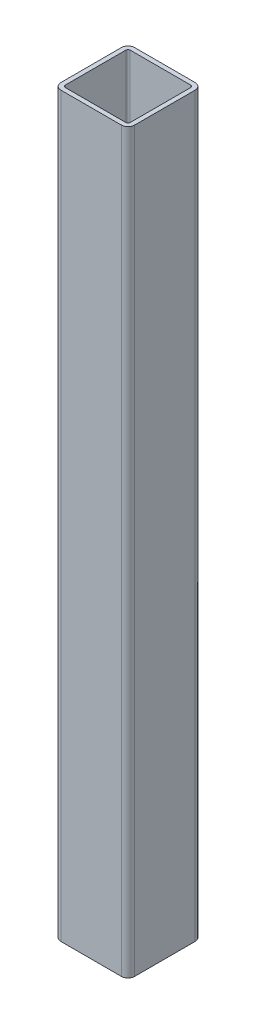
ISO-10303-21;
HEADER;
FILE_DESCRIPTION(('STEP AP214'),'2;1');
FILE_NAME('part.step','',(''),(''),'','','');
FILE_SCHEMA(('AUTOMOTIVE_DESIGN { 1 0 10303 214 1 1 1 1 }'));
ENDSEC;
DATA;
#1=APPLICATION_CONTEXT('core data for automotive mechanical design processes');
#2=APPLICATION_PROTOCOL_DEFINITION('international standard','automotive_design',2000,#1);
#3=PRODUCT_CONTEXT('',#1,'mechanical');
#4=PRODUCT('Part','Part','',(#3));
#5=PRODUCT_RELATED_PRODUCT_CATEGORY('part','',(#4));
#6=PRODUCT_DEFINITION_FORMATION('','',#4);
#7=PRODUCT_DEFINITION_CONTEXT('part definition',#1,'design');
#8=PRODUCT_DEFINITION('design','',#6,#7);
#9=PRODUCT_DEFINITION_SHAPE('','',#8);
#10=(LENGTH_UNIT() NAMED_UNIT(*) SI_UNIT(.MILLI.,.METRE.));
#11=(NAMED_UNIT(*) PLANE_ANGLE_UNIT() SI_UNIT($,.RADIAN.));
#12=(NAMED_UNIT(*) SI_UNIT($,.STERADIAN.) SOLID_ANGLE_UNIT());
#13=UNCERTAINTY_MEASURE_WITH_UNIT(LENGTH_MEASURE(1.E-05),#10,'distance_accuracy_value','');
#14=(GEOMETRIC_REPRESENTATION_CONTEXT(3) GLOBAL_UNCERTAINTY_ASSIGNED_CONTEXT((#13)) GLOBAL_UNIT_ASSIGNED_CONTEXT((#10,
#11,#12)) REPRESENTATION_CONTEXT('',''));
#15=CARTESIAN_POINT('',(0.,0.,0.));
#16=DIRECTION('',(0.,0.,1.));
#17=DIRECTION('',(1.,0.,0.));
#18=AXIS2_PLACEMENT_3D('',#15,#16,#17);
#19=CARTESIAN_POINT('',(-20.5,500.,20.5));
#20=DIRECTION('',(0.,-1.,0.));
#21=DIRECTION('',(0.,0.,-1.));
#22=AXIS2_PLACEMENT_3D('',#19,#20,#21);
#23=CYLINDRICAL_SURFACE('',#22,1.5);
#24=CARTESIAN_POINT('',(-20.5,0.,20.5));
#25=DIRECTION('',(0.,1.,0.));
#26=DIRECTION('',(0.,0.,-1.));
#27=AXIS2_PLACEMENT_3D('',#24,#25,#26);
#28=CIRCLE('',#27,1.5);
#29=CARTESIAN_POINT('',(-22.,0.,20.5));
#30=VERTEX_POINT('',#29);
#31=CARTESIAN_POINT('',(-20.5,0.,22.));
#32=VERTEX_POINT('',#31);
#33=EDGE_CURVE('E236',#30,#32,#28,.T.);
#34=ORIENTED_EDGE('',*,*,#33,.F.);
#35=DIRECTION('',(0.,-1.,0.));
#36=VECTOR('',#35,1.);
#37=CARTESIAN_POINT('',(-22.,500.,20.5));
#38=LINE('',#37,#36);
#39=CARTESIAN_POINT('',(-22.,500.,20.5));
#40=VERTEX_POINT('',#39);
#41=EDGE_CURVE('E12',#40,#30,#38,.T.);
#42=ORIENTED_EDGE('',*,*,#41,.F.);
#43=CARTESIAN_POINT('',(-20.5,500.,20.5));
#44=DIRECTION('',(0.,1.,0.));
#45=DIRECTION('',(0.,0.,-1.));
#46=AXIS2_PLACEMENT_3D('',#43,#44,#45);
#47=CIRCLE('',#46,1.5);
#48=CARTESIAN_POINT('',(-20.5,500.,22.));
#49=VERTEX_POINT('',#48);
#50=EDGE_CURVE('E321',#40,#49,#47,.T.);
#51=ORIENTED_EDGE('',*,*,#50,.T.);
#52=DIRECTION('',(0.,-1.,0.));
#53=VECTOR('',#52,1.);
#54=CARTESIAN_POINT('',(-20.5,500.,22.));
#55=LINE('',#54,#53);
#56=EDGE_CURVE('E88',#49,#32,#55,.T.);
#57=ORIENTED_EDGE('',*,*,#56,.T.);
#58=EDGE_LOOP('',(#34,#42,#51,#57));
#59=FACE_BOUND('',#58,.T.);
#60=ADVANCED_FACE('F69',(#59),#23,.F.);
#61=CARTESIAN_POINT('',(-22.,500.,20.5));
#62=DIRECTION('',(1.,0.,0.));
#63=DIRECTION('',(0.,0.,-1.));
#64=AXIS2_PLACEMENT_3D('',#61,#62,#63);
#65=PLANE('',#64);
#66=DIRECTION('',(0.,0.,1.));
#67=VECTOR('',#66,1.);
#68=CARTESIAN_POINT('',(-22.,0.,20.5));
#69=LINE('',#68,#67);
#70=CARTESIAN_POINT('',(-22.,0.,-20.5));
#71=VERTEX_POINT('',#70);
#72=EDGE_CURVE('E238',#71,#30,#69,.T.);
#73=ORIENTED_EDGE('',*,*,#72,.F.);
#74=DIRECTION('',(0.,-1.,0.));
#75=VECTOR('',#74,1.);
#76=CARTESIAN_POINT('',(-22.,500.,-20.5));
#77=LINE('',#76,#75);
#78=CARTESIAN_POINT('',(-22.,500.,-20.5));
#79=VERTEX_POINT('',#78);
#80=EDGE_CURVE('E79',#79,#71,#77,.T.);
#81=ORIENTED_EDGE('',*,*,#80,.F.);
#82=DIRECTION('',(0.,0.,1.));
#83=VECTOR('',#82,1.);
#84=CARTESIAN_POINT('',(-22.,500.,20.5));
#85=LINE('',#84,#83);
#86=EDGE_CURVE('E323',#79,#40,#85,.T.);
#87=ORIENTED_EDGE('',*,*,#86,.T.);
#88=ORIENTED_EDGE('',*,*,#41,.T.);
#89=EDGE_LOOP('',(#73,#81,#87,#88));
#90=FACE_BOUND('',#89,.T.);
#91=ADVANCED_FACE('F350',(#90),#65,.T.);
#92=CARTESIAN_POINT('',(-20.5,500.,-20.5));
#93=DIRECTION('',(0.,-1.,0.));
#94=DIRECTION('',(0.,0.,-1.));
#95=AXIS2_PLACEMENT_3D('',#92,#93,#94);
#96=CYLINDRICAL_SURFACE('',#95,1.5);
#97=CARTESIAN_POINT('',(-20.5,0.,-20.5));
#98=DIRECTION('',(0.,1.,0.));
#99=DIRECTION('',(0.,0.,-1.));
#100=AXIS2_PLACEMENT_3D('',#97,#98,#99);
#101=CIRCLE('',#100,1.5);
#102=CARTESIAN_POINT('',(-20.5,0.,-22.));
#103=VERTEX_POINT('',#102);
#104=EDGE_CURVE('E241',#103,#71,#101,.T.);
#105=ORIENTED_EDGE('',*,*,#104,.F.);
#106=DIRECTION('',(0.,-1.,0.));
#107=VECTOR('',#106,1.);
#108=CARTESIAN_POINT('',(-20.5,500.,-22.));
#109=LINE('',#108,#107);
#110=CARTESIAN_POINT('',(-20.5,500.,-22.));
#111=VERTEX_POINT('',#110);
#112=EDGE_CURVE('E262',#111,#103,#109,.T.);
#113=ORIENTED_EDGE('',*,*,#112,.F.);
#114=CARTESIAN_POINT('',(-20.5,500.,-20.5));
#115=DIRECTION('',(0.,1.,0.));
#116=DIRECTION('',(0.,0.,-1.));
#117=AXIS2_PLACEMENT_3D('',#114,#115,#116);
#118=CIRCLE('',#117,1.5);
#119=EDGE_CURVE('E326',#111,#79,#118,.T.);
#120=ORIENTED_EDGE('',*,*,#119,.T.);
#121=ORIENTED_EDGE('',*,*,#80,.T.);
#122=EDGE_LOOP('',(#105,#113,#120,#121));
#123=FACE_BOUND('',#122,.T.);
#124=ADVANCED_FACE('F355',(#123),#96,.F.);
#125=CARTESIAN_POINT('',(-20.5,500.,-22.));
#126=DIRECTION('',(0.,0.,1.));
#127=DIRECTION('',(1.,0.,0.));
#128=AXIS2_PLACEMENT_3D('',#125,#126,#127);
#129=PLANE('',#128);
#130=DIRECTION('',(-1.,0.,0.));
#131=VECTOR('',#130,1.);
#132=CARTESIAN_POINT('',(-20.5,0.,-22.));
#133=LINE('',#132,#131);
#134=CARTESIAN_POINT('',(20.5,0.,-22.));
#135=VERTEX_POINT('',#134);
#136=EDGE_CURVE('E244',#135,#103,#133,.T.);
#137=ORIENTED_EDGE('',*,*,#136,.F.);
#138=DIRECTION('',(0.,-1.,0.));
#139=VECTOR('',#138,1.);
#140=CARTESIAN_POINT('',(20.5,500.,-22.));
#141=LINE('',#140,#139);
#142=CARTESIAN_POINT('',(20.5,500.,-22.));
#143=VERTEX_POINT('',#142);
#144=EDGE_CURVE('E260',#143,#135,#141,.T.);
#145=ORIENTED_EDGE('',*,*,#144,.F.);
#146=DIRECTION('',(-1.,0.,0.));
#147=VECTOR('',#146,1.);
#148=CARTESIAN_POINT('',(-20.5,500.,-22.));
#149=LINE('',#148,#147);
#150=EDGE_CURVE('E329',#143,#111,#149,.T.);
#151=ORIENTED_EDGE('',*,*,#150,.T.);
#152=ORIENTED_EDGE('',*,*,#112,.T.);
#153=EDGE_LOOP('',(#137,#145,#151,#152));
#154=FACE_BOUND('',#153,.T.);
#155=ADVANCED_FACE('F388',(#154),#129,.T.);
#156=CARTESIAN_POINT('',(20.5,500.,-20.5));
#157=DIRECTION('',(0.,-1.,0.));
#158=DIRECTION('',(0.,0.,-1.));
#159=AXIS2_PLACEMENT_3D('',#156,#157,#158);
#160=CYLINDRICAL_SURFACE('',#159,1.5);
#161=CARTESIAN_POINT('',(20.5,0.,-20.5));
#162=DIRECTION('',(0.,1.,0.));
#163=DIRECTION('',(0.,0.,-1.));
#164=AXIS2_PLACEMENT_3D('',#161,#162,#163);
#165=CIRCLE('',#164,1.5);
#166=CARTESIAN_POINT('',(22.,0.,-20.5));
#167=VERTEX_POINT('',#166);
#168=EDGE_CURVE('E247',#167,#135,#165,.T.);
#169=ORIENTED_EDGE('',*,*,#168,.F.);
#170=DIRECTION('',(0.,-1.,0.));
#171=VECTOR('',#170,1.);
#172=CARTESIAN_POINT('',(22.,500.,-20.5));
#173=LINE('',#172,#171);
#174=CARTESIAN_POINT('',(22.,500.,-20.5));
#175=VERTEX_POINT('',#174);
#176=EDGE_CURVE('E199',#175,#167,#173,.T.);
#177=ORIENTED_EDGE('',*,*,#176,.F.);
#178=CARTESIAN_POINT('',(20.5,500.,-20.5));
#179=DIRECTION('',(0.,1.,0.));
#180=DIRECTION('',(0.,0.,-1.));
#181=AXIS2_PLACEMENT_3D('',#178,#179,#180);
#182=CIRCLE('',#181,1.5);
#183=EDGE_CURVE('E210',#175,#143,#182,.T.);
#184=ORIENTED_EDGE('',*,*,#183,.T.);
#185=ORIENTED_EDGE('',*,*,#144,.T.);
#186=EDGE_LOOP('',(#169,#177,#184,#185));
#187=FACE_BOUND('',#186,.T.);
#188=ADVANCED_FACE('F333',(#187),#160,.F.);
#189=CARTESIAN_POINT('',(22.,500.,20.5));
#190=DIRECTION('',(-1.,0.,0.));
#191=DIRECTION('',(0.,0.,1.));
#192=AXIS2_PLACEMENT_3D('',#189,#190,#191);
#193=PLANE('',#192);
#194=DIRECTION('',(0.,0.,-1.));
#195=VECTOR('',#194,1.);
#196=CARTESIAN_POINT('',(22.,0.,20.5));
#197=LINE('',#196,#195);
#198=CARTESIAN_POINT('',(22.,0.,20.5));
#199=VERTEX_POINT('',#198);
#200=EDGE_CURVE('E195',#199,#167,#197,.T.);
#201=ORIENTED_EDGE('',*,*,#200,.F.);
#202=DIRECTION('',(0.,-1.,0.));
#203=VECTOR('',#202,1.);
#204=CARTESIAN_POINT('',(22.,500.,20.5));
#205=LINE('',#204,#203);
#206=CARTESIAN_POINT('',(22.,500.,20.5));
#207=VERTEX_POINT('',#206);
#208=EDGE_CURVE('E190',#207,#199,#205,.T.);
#209=ORIENTED_EDGE('',*,*,#208,.F.);
#210=DIRECTION('',(0.,0.,-1.));
#211=VECTOR('',#210,1.);
#212=CARTESIAN_POINT('',(22.,500.,20.5));
#213=LINE('',#212,#211);
#214=EDGE_CURVE('E193',#207,#175,#213,.T.);
#215=ORIENTED_EDGE('',*,*,#214,.T.);
#216=ORIENTED_EDGE('',*,*,#176,.T.);
#217=EDGE_LOOP('',(#201,#209,#215,#216));
#218=FACE_BOUND('',#217,.T.);
#219=ADVANCED_FACE('F192',(#218),#193,.T.);
#220=CARTESIAN_POINT('',(20.5,500.,20.5));
#221=DIRECTION('',(0.,-1.,0.));
#222=DIRECTION('',(0.,0.,-1.));
#223=AXIS2_PLACEMENT_3D('',#220,#221,#222);
#224=CYLINDRICAL_SURFACE('',#223,1.5);
#225=CARTESIAN_POINT('',(20.5,0.,20.5));
#226=DIRECTION('',(0.,1.,0.));
#227=DIRECTION('',(0.,0.,1.));
#228=AXIS2_PLACEMENT_3D('',#225,#226,#227);
#229=CIRCLE('',#228,1.5);
#230=CARTESIAN_POINT('',(20.5,0.,22.));
#231=VERTEX_POINT('',#230);
#232=EDGE_CURVE('E251',#231,#199,#229,.T.);
#233=ORIENTED_EDGE('',*,*,#232,.F.);
#234=DIRECTION('',(0.,-1.,0.));
#235=VECTOR('',#234,1.);
#236=CARTESIAN_POINT('',(20.5,500.,22.));
#237=LINE('',#236,#235);
#238=CARTESIAN_POINT('',(20.5,500.,22.));
#239=VERTEX_POINT('',#238);
#240=EDGE_CURVE('E137',#239,#231,#237,.T.);
#241=ORIENTED_EDGE('',*,*,#240,.F.);
#242=CARTESIAN_POINT('',(20.5,500.,20.5));
#243=DIRECTION('',(0.,1.,0.));
#244=DIRECTION('',(0.,0.,1.));
#245=AXIS2_PLACEMENT_3D('',#242,#243,#244);
#246=CIRCLE('',#245,1.5);
#247=EDGE_CURVE('E207',#239,#207,#246,.T.);
#248=ORIENTED_EDGE('',*,*,#247,.T.);
#249=ORIENTED_EDGE('',*,*,#208,.T.);
#250=EDGE_LOOP('',(#233,#241,#248,#249));
#251=FACE_BOUND('',#250,.T.);
#252=ADVANCED_FACE('F212',(#251),#224,.F.);
#253=CARTESIAN_POINT('',(-20.5,500.,-20.5));
#254=DIRECTION('',(0.,-1.,0.));
#255=DIRECTION('',(0.,0.,-1.));
#256=AXIS2_PLACEMENT_3D('',#253,#254,#255);
#257=CYLINDRICAL_SURFACE('',#256,4.5);
#258=CARTESIAN_POINT('',(-20.5,0.,-20.5));
#259=DIRECTION('',(0.,1.,0.));
#260=DIRECTION('',(0.,0.,-1.));
#261=AXIS2_PLACEMENT_3D('',#258,#259,#260);
#262=CIRCLE('',#261,4.5);
#263=CARTESIAN_POINT('',(-20.5,0.,-25.));
#264=VERTEX_POINT('',#263);
#265=CARTESIAN_POINT('',(-25.,0.,-20.5));
#266=VERTEX_POINT('',#265);
#267=EDGE_CURVE('E219',#264,#266,#262,.T.);
#268=ORIENTED_EDGE('',*,*,#267,.T.);
#269=DIRECTION('',(0.,-1.,0.));
#270=VECTOR('',#269,1.);
#271=CARTESIAN_POINT('',(-25.,500.,-20.5));
#272=LINE('',#271,#270);
#273=CARTESIAN_POINT('',(-25.,500.,-20.5));
#274=VERTEX_POINT('',#273);
#275=EDGE_CURVE('E73',#274,#266,#272,.T.);
#276=ORIENTED_EDGE('',*,*,#275,.F.);
#277=CARTESIAN_POINT('',(-20.5,500.,-20.5));
#278=DIRECTION('',(0.,1.,0.));
#279=DIRECTION('',(0.,0.,-1.));
#280=AXIS2_PLACEMENT_3D('',#277,#278,#279);
#281=CIRCLE('',#280,4.5);
#282=CARTESIAN_POINT('',(-20.5,500.,-25.));
#283=VERTEX_POINT('',#282);
#284=EDGE_CURVE('E256',#283,#274,#281,.T.);
#285=ORIENTED_EDGE('',*,*,#284,.F.);
#286=DIRECTION('',(0.,-1.,0.));
#287=VECTOR('',#286,1.);
#288=CARTESIAN_POINT('',(-20.5,500.,-25.));
#289=LINE('',#288,#287);
#290=EDGE_CURVE('E215',#283,#264,#289,.T.);
#291=ORIENTED_EDGE('',*,*,#290,.T.);
#292=EDGE_LOOP('',(#268,#276,#285,#291));
#293=FACE_BOUND('',#292,.T.);
#294=ADVANCED_FACE('F71',(#293),#257,.T.);
#295=CARTESIAN_POINT('',(-25.,500.,20.5));
#296=DIRECTION('',(1.,0.,0.));
#297=DIRECTION('',(0.,0.,-1.));
#298=AXIS2_PLACEMENT_3D('',#295,#296,#297);
#299=PLANE('',#298);
#300=DIRECTION('',(0.,0.,1.));
#301=VECTOR('',#300,1.);
#302=CARTESIAN_POINT('',(-25.,0.,20.5));
#303=LINE('',#302,#301);
#304=CARTESIAN_POINT('',(-25.,0.,20.5));
#305=VERTEX_POINT('',#304);
#306=EDGE_CURVE('E222',#266,#305,#303,.T.);
#307=ORIENTED_EDGE('',*,*,#306,.T.);
#308=DIRECTION('',(0.,-1.,0.));
#309=VECTOR('',#308,1.);
#310=CARTESIAN_POINT('',(-25.,500.,20.5));
#311=LINE('',#310,#309);
#312=CARTESIAN_POINT('',(-25.,500.,20.5));
#313=VERTEX_POINT('',#312);
#314=EDGE_CURVE('E281',#313,#305,#311,.T.);
#315=ORIENTED_EDGE('',*,*,#314,.F.);
#316=DIRECTION('',(0.,0.,1.));
#317=VECTOR('',#316,1.);
#318=CARTESIAN_POINT('',(-25.,500.,20.5));
#319=LINE('',#318,#317);
#320=EDGE_CURVE('E150',#274,#313,#319,.T.);
#321=ORIENTED_EDGE('',*,*,#320,.F.);
#322=ORIENTED_EDGE('',*,*,#275,.T.);
#323=EDGE_LOOP('',(#307,#315,#321,#322));
#324=FACE_BOUND('',#323,.T.);
#325=ADVANCED_FACE('F287',(#324),#299,.F.);
#326=CARTESIAN_POINT('',(-20.5,500.,20.5));
#327=DIRECTION('',(0.,-1.,0.));
#328=DIRECTION('',(0.,0.,-1.));
#329=AXIS2_PLACEMENT_3D('',#326,#327,#328);
#330=CYLINDRICAL_SURFACE('',#329,4.5);
#331=CARTESIAN_POINT('',(-20.5,0.,20.5));
#332=DIRECTION('',(0.,1.,0.));
#333=DIRECTION('',(0.,0.,-1.));
#334=AXIS2_PLACEMENT_3D('',#331,#332,#333);
#335=CIRCLE('',#334,4.5);
#336=CARTESIAN_POINT('',(-20.5,0.,25.));
#337=VERTEX_POINT('',#336);
#338=EDGE_CURVE('E224',#305,#337,#335,.T.);
#339=ORIENTED_EDGE('',*,*,#338,.T.);
#340=DIRECTION('',(0.,-1.,0.));
#341=VECTOR('',#340,1.);
#342=CARTESIAN_POINT('',(-20.5,500.,25.));
#343=LINE('',#342,#341);
#344=CARTESIAN_POINT('',(-20.5,500.,25.));
#345=VERTEX_POINT('',#344);
#346=EDGE_CURVE('E279',#345,#337,#343,.T.);
#347=ORIENTED_EDGE('',*,*,#346,.F.);
#348=CARTESIAN_POINT('',(-20.5,500.,20.5));
#349=DIRECTION('',(0.,1.,0.));
#350=DIRECTION('',(0.,0.,-1.));
#351=AXIS2_PLACEMENT_3D('',#348,#349,#350);
#352=CIRCLE('',#351,4.5);
#353=EDGE_CURVE('E309',#313,#345,#352,.T.);
#354=ORIENTED_EDGE('',*,*,#353,.F.);
#355=ORIENTED_EDGE('',*,*,#314,.T.);
#356=EDGE_LOOP('',(#339,#347,#354,#355));
#357=FACE_BOUND('',#356,.T.);
#358=ADVANCED_FACE('F300',(#357),#330,.T.);
#359=CARTESIAN_POINT('',(-20.5,500.,25.));
#360=DIRECTION('',(0.,0.,-1.));
#361=DIRECTION('',(-1.,0.,0.));
#362=AXIS2_PLACEMENT_3D('',#359,#360,#361);
#363=PLANE('',#362);
#364=DIRECTION('',(1.,0.,0.));
#365=VECTOR('',#364,1.);
#366=CARTESIAN_POINT('',(-20.5,0.,25.));
#367=LINE('',#366,#365);
#368=CARTESIAN_POINT('',(20.5,0.,25.));
#369=VERTEX_POINT('',#368);
#370=EDGE_CURVE('E226',#337,#369,#367,.T.);
#371=ORIENTED_EDGE('',*,*,#370,.T.);
#372=DIRECTION('',(0.,-1.,0.));
#373=VECTOR('',#372,1.);
#374=CARTESIAN_POINT('',(20.5,500.,25.));
#375=LINE('',#374,#373);
#376=CARTESIAN_POINT('',(20.5,500.,25.));
#377=VERTEX_POINT('',#376);
#378=EDGE_CURVE('E276',#377,#369,#375,.T.);
#379=ORIENTED_EDGE('',*,*,#378,.F.);
#380=DIRECTION('',(1.,0.,0.));
#381=VECTOR('',#380,1.);
#382=CARTESIAN_POINT('',(-20.5,500.,25.));
#383=LINE('',#382,#381);
#384=EDGE_CURVE('E305',#345,#377,#383,.T.);
#385=ORIENTED_EDGE('',*,*,#384,.F.);
#386=ORIENTED_EDGE('',*,*,#346,.T.);
#387=EDGE_LOOP('',(#371,#379,#385,#386));
#388=FACE_BOUND('',#387,.T.);
#389=ADVANCED_FACE('F303',(#388),#363,.F.);
#390=CARTESIAN_POINT('',(20.5,500.,20.5));
#391=DIRECTION('',(0.,-1.,0.));
#392=DIRECTION('',(0.,0.,-1.));
#393=AXIS2_PLACEMENT_3D('',#390,#391,#392);
#394=CYLINDRICAL_SURFACE('',#393,4.5);
#395=CARTESIAN_POINT('',(20.5,0.,20.5));
#396=DIRECTION('',(0.,1.,0.));
#397=DIRECTION('',(0.,0.,1.));
#398=AXIS2_PLACEMENT_3D('',#395,#396,#397);
#399=CIRCLE('',#398,4.5);
#400=CARTESIAN_POINT('',(25.,0.,20.5));
#401=VERTEX_POINT('',#400);
#402=EDGE_CURVE('E228',#369,#401,#399,.T.);
#403=ORIENTED_EDGE('',*,*,#402,.T.);
#404=DIRECTION('',(0.,-1.,0.));
#405=VECTOR('',#404,1.);
#406=CARTESIAN_POINT('',(25.,500.,20.5));
#407=LINE('',#406,#405);
#408=CARTESIAN_POINT('',(25.,500.,20.5));
#409=VERTEX_POINT('',#408);
#410=EDGE_CURVE('E273',#409,#401,#407,.T.);
#411=ORIENTED_EDGE('',*,*,#410,.F.);
#412=CARTESIAN_POINT('',(20.5,500.,20.5));
#413=DIRECTION('',(0.,1.,0.));
#414=DIRECTION('',(0.,0.,1.));
#415=AXIS2_PLACEMENT_3D('',#412,#413,#414);
#416=CIRCLE('',#415,4.5);
#417=EDGE_CURVE('E308',#377,#409,#416,.T.);
#418=ORIENTED_EDGE('',*,*,#417,.F.);
#419=ORIENTED_EDGE('',*,*,#378,.T.);
#420=EDGE_LOOP('',(#403,#411,#418,#419));
#421=FACE_BOUND('',#420,.T.);
#422=ADVANCED_FACE('F366',(#421),#394,.T.);
#423=CARTESIAN_POINT('',(25.,500.,20.5));
#424=DIRECTION('',(-1.,0.,0.));
#425=DIRECTION('',(0.,0.,1.));
#426=AXIS2_PLACEMENT_3D('',#423,#424,#425);
#427=PLANE('',#426);
#428=DIRECTION('',(0.,0.,-1.));
#429=VECTOR('',#428,1.);
#430=CARTESIAN_POINT('',(25.,0.,20.5));
#431=LINE('',#430,#429);
#432=CARTESIAN_POINT('',(25.,0.,-20.5));
#433=VERTEX_POINT('',#432);
#434=EDGE_CURVE('E230',#401,#433,#431,.T.);
#435=ORIENTED_EDGE('',*,*,#434,.T.);
#436=DIRECTION('',(0.,-1.,0.));
#437=VECTOR('',#436,1.);
#438=CARTESIAN_POINT('',(25.,500.,-20.5));
#439=LINE('',#438,#437);
#440=CARTESIAN_POINT('',(25.,500.,-20.5));
#441=VERTEX_POINT('',#440);
#442=EDGE_CURVE('E270',#441,#433,#439,.T.);
#443=ORIENTED_EDGE('',*,*,#442,.F.);
#444=DIRECTION('',(0.,0.,-1.));
#445=VECTOR('',#444,1.);
#446=CARTESIAN_POINT('',(25.,500.,20.5));
#447=LINE('',#446,#445);
#448=EDGE_CURVE('E311',#409,#441,#447,.T.);
#449=ORIENTED_EDGE('',*,*,#448,.F.);
#450=ORIENTED_EDGE('',*,*,#410,.T.);
#451=EDGE_LOOP('',(#435,#443,#449,#450));
#452=FACE_BOUND('',#451,.T.);
#453=ADVANCED_FACE('F362',(#452),#427,.F.);
#454=CARTESIAN_POINT('',(20.5,500.,-20.5));
#455=DIRECTION('',(0.,-1.,0.));
#456=DIRECTION('',(0.,0.,-1.));
#457=AXIS2_PLACEMENT_3D('',#454,#455,#456);
#458=CYLINDRICAL_SURFACE('',#457,4.5);
#459=CARTESIAN_POINT('',(20.5,0.,-20.5));
#460=DIRECTION('',(0.,1.,0.));
#461=DIRECTION('',(0.,0.,-1.));
#462=AXIS2_PLACEMENT_3D('',#459,#460,#461);
#463=CIRCLE('',#462,4.5);
#464=CARTESIAN_POINT('',(20.5,0.,-25.));
#465=VERTEX_POINT('',#464);
#466=EDGE_CURVE('E232',#433,#465,#463,.T.);
#467=ORIENTED_EDGE('',*,*,#466,.T.);
#468=DIRECTION('',(0.,-1.,0.));
#469=VECTOR('',#468,1.);
#470=CARTESIAN_POINT('',(20.5,500.,-25.));
#471=LINE('',#470,#469);
#472=CARTESIAN_POINT('',(20.5,500.,-25.));
#473=VERTEX_POINT('',#472);
#474=EDGE_CURVE('E267',#473,#465,#471,.T.);
#475=ORIENTED_EDGE('',*,*,#474,.F.);
#476=CARTESIAN_POINT('',(20.5,500.,-20.5));
#477=DIRECTION('',(0.,1.,0.));
#478=DIRECTION('',(0.,0.,-1.));
#479=AXIS2_PLACEMENT_3D('',#476,#477,#478);
#480=CIRCLE('',#479,4.5);
#481=EDGE_CURVE('E317',#441,#473,#480,.T.);
#482=ORIENTED_EDGE('',*,*,#481,.F.);
#483=ORIENTED_EDGE('',*,*,#442,.T.);
#484=EDGE_LOOP('',(#467,#475,#482,#483));
#485=FACE_BOUND('',#484,.T.);
#486=ADVANCED_FACE('F344',(#485),#458,.T.);
#487=CARTESIAN_POINT('',(-20.5,500.,-25.));
#488=DIRECTION('',(0.,0.,1.));
#489=DIRECTION('',(1.,0.,0.));
#490=AXIS2_PLACEMENT_3D('',#487,#488,#489);
#491=PLANE('',#490);
#492=DIRECTION('',(-1.,0.,0.));
#493=VECTOR('',#492,1.);
#494=CARTESIAN_POINT('',(-20.5,0.,-25.));
#495=LINE('',#494,#493);
#496=EDGE_CURVE('E234',#465,#264,#495,.T.);
#497=ORIENTED_EDGE('',*,*,#496,.T.);
#498=ORIENTED_EDGE('',*,*,#290,.F.);
#499=DIRECTION('',(-1.,0.,0.));
#500=VECTOR('',#499,1.);
#501=CARTESIAN_POINT('',(-20.5,500.,-25.));
#502=LINE('',#501,#500);
#503=EDGE_CURVE('E319',#473,#283,#502,.T.);
#504=ORIENTED_EDGE('',*,*,#503,.F.);
#505=ORIENTED_EDGE('',*,*,#474,.T.);
#506=EDGE_LOOP('',(#497,#498,#504,#505));
#507=FACE_BOUND('',#506,.T.);
#508=ADVANCED_FACE('F337',(#507),#491,.F.);
#509=CARTESIAN_POINT('',(-20.5,500.,22.));
#510=DIRECTION('',(0.,0.,-1.));
#511=DIRECTION('',(-1.,0.,0.));
#512=AXIS2_PLACEMENT_3D('',#509,#510,#511);
#513=PLANE('',#512);
#514=DIRECTION('',(1.,0.,0.));
#515=VECTOR('',#514,1.);
#516=CARTESIAN_POINT('',(-20.5,0.,22.));
#517=LINE('',#516,#515);
#518=EDGE_CURVE('E253',#32,#231,#517,.T.);
#519=ORIENTED_EDGE('',*,*,#518,.F.);
#520=ORIENTED_EDGE('',*,*,#56,.F.);
#521=DIRECTION('',(1.,0.,0.));
#522=VECTOR('',#521,1.);
#523=CARTESIAN_POINT('',(-20.5,500.,22.));
#524=LINE('',#523,#522);
#525=EDGE_CURVE('E213',#49,#239,#524,.T.);
#526=ORIENTED_EDGE('',*,*,#525,.T.);
#527=ORIENTED_EDGE('',*,*,#240,.T.);
#528=EDGE_LOOP('',(#519,#520,#526,#527));
#529=FACE_BOUND('',#528,.T.);
#530=ADVANCED_FACE('F335',(#529),#513,.T.);
#531=CARTESIAN_POINT('',(-20.5,500.,-20.5));
#532=DIRECTION('',(0.,-1.,0.));
#533=DIRECTION('',(0.,0.,-1.));
#534=AXIS2_PLACEMENT_3D('',#531,#532,#533);
#535=PLANE('',#534);
#536=ORIENTED_EDGE('',*,*,#284,.T.);
#537=ORIENTED_EDGE('',*,*,#320,.T.);
#538=ORIENTED_EDGE('',*,*,#353,.T.);
#539=ORIENTED_EDGE('',*,*,#384,.T.);
#540=ORIENTED_EDGE('',*,*,#417,.T.);
#541=ORIENTED_EDGE('',*,*,#448,.T.);
#542=ORIENTED_EDGE('',*,*,#481,.T.);
#543=ORIENTED_EDGE('',*,*,#503,.T.);
#544=EDGE_LOOP('',(#536,#537,#538,#539,#540,#541,#542,#543));
#545=FACE_BOUND('',#544,.T.);
#546=ORIENTED_EDGE('',*,*,#50,.F.);
#547=ORIENTED_EDGE('',*,*,#86,.F.);
#548=ORIENTED_EDGE('',*,*,#119,.F.);
#549=ORIENTED_EDGE('',*,*,#150,.F.);
#550=ORIENTED_EDGE('',*,*,#183,.F.);
#551=ORIENTED_EDGE('',*,*,#214,.F.);
#552=ORIENTED_EDGE('',*,*,#247,.F.);
#553=ORIENTED_EDGE('',*,*,#525,.F.);
#554=EDGE_LOOP('',(#546,#547,#548,#549,#550,#551,#552,#553));
#555=FACE_BOUND('',#554,.T.);
#556=ADVANCED_FACE('F205',(#545,#555),#535,.F.);
#557=CARTESIAN_POINT('',(-20.5,0.,-20.5));
#558=DIRECTION('',(0.,-1.,0.));
#559=DIRECTION('',(0.,0.,-1.));
#560=AXIS2_PLACEMENT_3D('',#557,#558,#559);
#561=PLANE('',#560);
#562=ORIENTED_EDGE('',*,*,#267,.F.);
#563=ORIENTED_EDGE('',*,*,#496,.F.);
#564=ORIENTED_EDGE('',*,*,#466,.F.);
#565=ORIENTED_EDGE('',*,*,#434,.F.);
#566=ORIENTED_EDGE('',*,*,#402,.F.);
#567=ORIENTED_EDGE('',*,*,#370,.F.);
#568=ORIENTED_EDGE('',*,*,#338,.F.);
#569=ORIENTED_EDGE('',*,*,#306,.F.);
#570=EDGE_LOOP('',(#562,#563,#564,#565,#566,#567,#568,#569));
#571=FACE_BOUND('',#570,.T.);
#572=ORIENTED_EDGE('',*,*,#33,.T.);
#573=ORIENTED_EDGE('',*,*,#518,.T.);
#574=ORIENTED_EDGE('',*,*,#232,.T.);
#575=ORIENTED_EDGE('',*,*,#200,.T.);
#576=ORIENTED_EDGE('',*,*,#168,.T.);
#577=ORIENTED_EDGE('',*,*,#136,.T.);
#578=ORIENTED_EDGE('',*,*,#104,.T.);
#579=ORIENTED_EDGE('',*,*,#72,.T.);
#580=EDGE_LOOP('',(#572,#573,#574,#575,#576,#577,#578,#579));
#581=FACE_BOUND('',#580,.T.);
#582=ADVANCED_FACE('F294',(#571,#581),#561,.T.);
#583=CLOSED_SHELL('',(#60,#91,#124,#155,#188,#219,#252,#294,#325,#358,#389,#422,#453,#486,#508,
#530,#556,#582));
#584=MANIFOLD_SOLID_BREP('B2',#583);
#585=ADVANCED_BREP_SHAPE_REPRESENTATION('',(#18,#584),#14);
#586=SHAPE_DEFINITION_REPRESENTATION(#9,#585);
ENDSEC;
END-ISO-10303-21;
